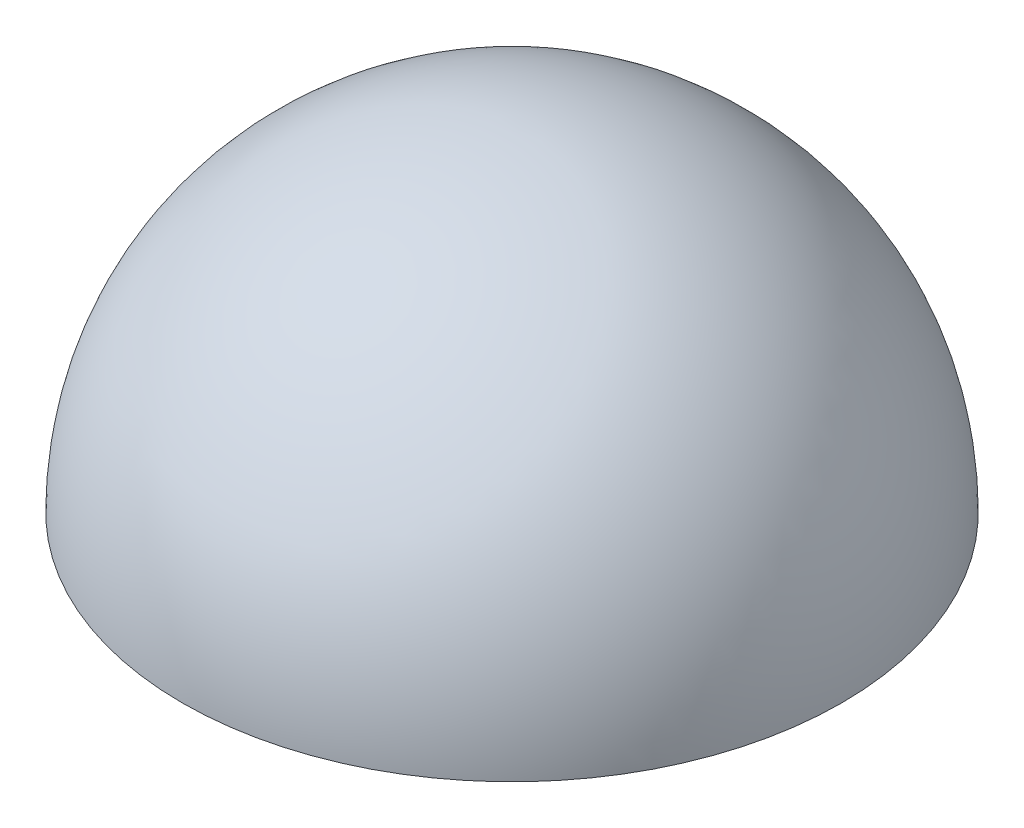
ISO-10303-21;
HEADER;
FILE_DESCRIPTION(('STEP AP214'),'2;1');
FILE_NAME('part.step','',(''),(''),'','','');
FILE_SCHEMA(('AUTOMOTIVE_DESIGN { 1 0 10303 214 1 1 1 1 }'));
ENDSEC;
DATA;
#1=APPLICATION_CONTEXT('core data for automotive mechanical design processes');
#2=APPLICATION_PROTOCOL_DEFINITION('international standard','automotive_design',2000,#1);
#3=PRODUCT_CONTEXT('',#1,'mechanical');
#4=PRODUCT('Part','Part','',(#3));
#5=PRODUCT_RELATED_PRODUCT_CATEGORY('part','',(#4));
#6=PRODUCT_DEFINITION_FORMATION('','',#4);
#7=PRODUCT_DEFINITION_CONTEXT('part definition',#1,'design');
#8=PRODUCT_DEFINITION('design','',#6,#7);
#9=PRODUCT_DEFINITION_SHAPE('','',#8);
#10=(LENGTH_UNIT() NAMED_UNIT(*) SI_UNIT(.MILLI.,.METRE.));
#11=(NAMED_UNIT(*) PLANE_ANGLE_UNIT() SI_UNIT($,.RADIAN.));
#12=(NAMED_UNIT(*) SI_UNIT($,.STERADIAN.) SOLID_ANGLE_UNIT());
#13=UNCERTAINTY_MEASURE_WITH_UNIT(LENGTH_MEASURE(1.E-05),#10,'distance_accuracy_value','');
#14=(GEOMETRIC_REPRESENTATION_CONTEXT(3) GLOBAL_UNCERTAINTY_ASSIGNED_CONTEXT((#13)) GLOBAL_UNIT_ASSIGNED_CONTEXT((#10,
#11,#12)) REPRESENTATION_CONTEXT('',''));
#15=CARTESIAN_POINT('',(0.,0.,0.));
#16=DIRECTION('',(0.,0.,1.));
#17=DIRECTION('',(1.,0.,0.));
#18=AXIS2_PLACEMENT_3D('',#15,#16,#17);
#19=CARTESIAN_POINT('',(0.,0.,0.));
#20=DIRECTION('',(0.,-1.,0.));
#21=DIRECTION('',(1.,0.,0.));
#22=AXIS2_PLACEMENT_3D('',#19,#20,#21);
#23=SPHERICAL_SURFACE('',#22,72.);
#24=CARTESIAN_POINT('',(0.,0.,0.));
#25=DIRECTION('',(0.,-1.,0.));
#26=DIRECTION('',(0.,0.,-1.));
#27=AXIS2_PLACEMENT_3D('',#24,#25,#26);
#28=CIRCLE('',#27,72.);
#29=CARTESIAN_POINT('',(0.,0.,-72.));
#30=VERTEX_POINT('',#29);
#31=EDGE_CURVE('E10',#30,#30,#28,.T.);
#32=ORIENTED_EDGE('',*,*,#31,.T.);
#33=EDGE_LOOP('',(#32));
#34=FACE_BOUND('',#33,.T.);
#35=ADVANCED_FACE('F33',(#34),#23,.F.);
#36=CARTESIAN_POINT('',(77.,0.,0.));
#37=DIRECTION('',(0.,-1.,0.));
#38=DIRECTION('',(0.,0.,-1.));
#39=AXIS2_PLACEMENT_3D('',#36,#37,#38);
#40=PLANE('',#39);
#41=CARTESIAN_POINT('',(0.,0.,0.));
#42=DIRECTION('',(0.,-1.,0.));
#43=DIRECTION('',(0.,0.,-1.));
#44=AXIS2_PLACEMENT_3D('',#41,#42,#43);
#45=CIRCLE('',#44,77.);
#46=CARTESIAN_POINT('',(0.,0.,-77.));
#47=VERTEX_POINT('',#46);
#48=EDGE_CURVE('E39',#47,#47,#45,.T.);
#49=ORIENTED_EDGE('',*,*,#48,.T.);
#50=EDGE_LOOP('',(#49));
#51=FACE_BOUND('',#50,.T.);
#52=ORIENTED_EDGE('',*,*,#31,.F.);
#53=EDGE_LOOP('',(#52));
#54=FACE_BOUND('',#53,.T.);
#55=ADVANCED_FACE('F45',(#51,#54),#40,.T.);
#56=CARTESIAN_POINT('',(0.,0.,0.));
#57=DIRECTION('',(0.,-1.,0.));
#58=DIRECTION('',(1.,0.,0.));
#59=AXIS2_PLACEMENT_3D('',#56,#57,#58);
#60=SPHERICAL_SURFACE('',#59,77.);
#61=ORIENTED_EDGE('',*,*,#48,.F.);
#62=EDGE_LOOP('',(#61));
#63=FACE_BOUND('',#62,.T.);
#64=ADVANCED_FACE('F48',(#63),#60,.T.);
#65=CLOSED_SHELL('',(#35,#55,#64));
#66=MANIFOLD_SOLID_BREP('B2',#65);
#67=ADVANCED_BREP_SHAPE_REPRESENTATION('',(#18,#66),#14);
#68=SHAPE_DEFINITION_REPRESENTATION(#9,#67);
ENDSEC;
END-ISO-10303-21;
